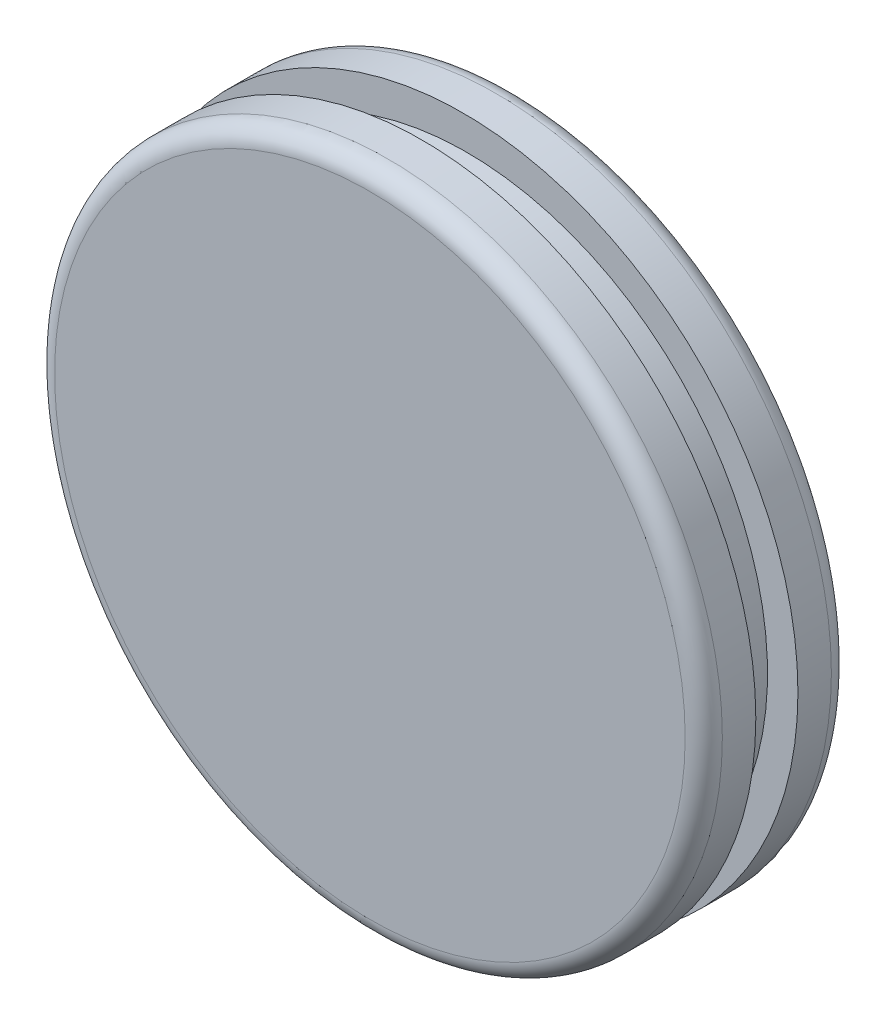
ISO-10303-21;
HEADER;
FILE_DESCRIPTION(('STEP AP214'),'2;1');
FILE_NAME('part.step','',(''),(''),'','','');
FILE_SCHEMA(('AUTOMOTIVE_DESIGN { 1 0 10303 214 1 1 1 1 }'));
ENDSEC;
DATA;
#1=APPLICATION_CONTEXT('core data for automotive mechanical design processes');
#2=APPLICATION_PROTOCOL_DEFINITION('international standard','automotive_design',2000,#1);
#3=PRODUCT_CONTEXT('',#1,'mechanical');
#4=PRODUCT('Part','Part','',(#3));
#5=PRODUCT_RELATED_PRODUCT_CATEGORY('part','',(#4));
#6=PRODUCT_DEFINITION_FORMATION('','',#4);
#7=PRODUCT_DEFINITION_CONTEXT('part definition',#1,'design');
#8=PRODUCT_DEFINITION('design','',#6,#7);
#9=PRODUCT_DEFINITION_SHAPE('','',#8);
#10=(LENGTH_UNIT() NAMED_UNIT(*) SI_UNIT(.MILLI.,.METRE.));
#11=(NAMED_UNIT(*) PLANE_ANGLE_UNIT() SI_UNIT($,.RADIAN.));
#12=(NAMED_UNIT(*) SI_UNIT($,.STERADIAN.) SOLID_ANGLE_UNIT());
#13=UNCERTAINTY_MEASURE_WITH_UNIT(LENGTH_MEASURE(1.E-05),#10,'distance_accuracy_value','');
#14=(GEOMETRIC_REPRESENTATION_CONTEXT(3) GLOBAL_UNCERTAINTY_ASSIGNED_CONTEXT((#13)) GLOBAL_UNIT_ASSIGNED_CONTEXT((#10,
#11,#12)) REPRESENTATION_CONTEXT('',''));
#15=CARTESIAN_POINT('',(0.,0.,0.));
#16=DIRECTION('',(0.,0.,1.));
#17=DIRECTION('',(1.,0.,0.));
#18=AXIS2_PLACEMENT_3D('',#15,#16,#17);
#19=CARTESIAN_POINT('',(0.,0.,3.556));
#20=DIRECTION('',(0.,0.,-1.));
#21=DIRECTION('',(-1.,0.,0.));
#22=AXIS2_PLACEMENT_3D('',#19,#20,#21);
#23=CYLINDRICAL_SURFACE('',#22,22.8119574669442);
#24=CARTESIAN_POINT('',(0.,0.,2.286));
#25=DIRECTION('',(0.,0.,1.));
#26=DIRECTION('',(1.,0.,0.));
#27=AXIS2_PLACEMENT_3D('',#24,#25,#26);
#28=CIRCLE('',#27,22.8119574669442);
#29=CARTESIAN_POINT('',(22.8119574669442,0.,2.286));
#30=VERTEX_POINT('',#29);
#31=EDGE_CURVE('E48',#30,#30,#28,.F.);
#32=ORIENTED_EDGE('',*,*,#31,.T.);
#33=EDGE_LOOP('',(#32));
#34=FACE_BOUND('',#33,.T.);
#35=CARTESIAN_POINT('',(0.,0.,0.));
#36=DIRECTION('',(0.,0.,1.));
#37=DIRECTION('',(1.,0.,0.));
#38=AXIS2_PLACEMENT_3D('',#35,#36,#37);
#39=CIRCLE('',#38,22.8119574669442);
#40=CARTESIAN_POINT('',(22.8119574669442,0.,0.));
#41=VERTEX_POINT('',#40);
#42=EDGE_CURVE('E58',#41,#41,#39,.T.);
#43=ORIENTED_EDGE('',*,*,#42,.T.);
#44=EDGE_LOOP('',(#43));
#45=FACE_BOUND('',#44,.T.);
#46=ADVANCED_FACE('F37',(#34,#45),#23,.T.);
#47=CARTESIAN_POINT('',(0.,0.,3.556));
#48=DIRECTION('',(0.,0.,1.));
#49=DIRECTION('',(1.,0.,0.));
#50=AXIS2_PLACEMENT_3D('',#47,#48,#49);
#51=PLANE('',#50);
#52=CARTESIAN_POINT('',(0.,0.,3.556));
#53=DIRECTION('',(0.,0.,1.));
#54=DIRECTION('',(1.,0.,0.));
#55=AXIS2_PLACEMENT_3D('',#52,#53,#54);
#56=CIRCLE('',#55,21.5419574669442);
#57=CARTESIAN_POINT('',(21.5419574669442,0.,3.556));
#58=VERTEX_POINT('',#57);
#59=EDGE_CURVE('E52',#58,#58,#56,.T.);
#60=ORIENTED_EDGE('',*,*,#59,.T.);
#61=EDGE_LOOP('',(#60));
#62=FACE_BOUND('',#61,.T.);
#63=ADVANCED_FACE('F86',(#62),#51,.T.);
#64=CARTESIAN_POINT('',(0.,0.,0.));
#65=DIRECTION('',(0.,0.,1.));
#66=DIRECTION('',(1.,0.,0.));
#67=AXIS2_PLACEMENT_3D('',#64,#65,#66);
#68=PLANE('',#67);
#69=CARTESIAN_POINT('',(0.,0.,0.));
#70=DIRECTION('',(0.,0.,-1.));
#71=DIRECTION('',(-1.,0.,0.));
#72=AXIS2_PLACEMENT_3D('',#69,#70,#71);
#73=CIRCLE('',#72,20.5653154438536);
#74=CARTESIAN_POINT('',(-20.5653154438536,0.,0.));
#75=VERTEX_POINT('',#74);
#76=EDGE_CURVE('E57',#75,#75,#73,.T.);
#77=ORIENTED_EDGE('',*,*,#76,.F.);
#78=EDGE_LOOP('',(#77));
#79=FACE_BOUND('',#78,.T.);
#80=ORIENTED_EDGE('',*,*,#42,.F.);
#81=EDGE_LOOP('',(#80));
#82=FACE_BOUND('',#81,.T.);
#83=ADVANCED_FACE('F92',(#79,#82),#68,.F.);
#84=CARTESIAN_POINT('',(0.,0.,-3.048));
#85=DIRECTION('',(0.,0.,1.));
#86=DIRECTION('',(1.,0.,0.));
#87=AXIS2_PLACEMENT_3D('',#84,#85,#86);
#88=CYLINDRICAL_SURFACE('',#87,20.5653154438536);
#89=CARTESIAN_POINT('',(0.,0.,-3.048));
#90=DIRECTION('',(0.,0.,-1.));
#91=DIRECTION('',(-1.,0.,0.));
#92=AXIS2_PLACEMENT_3D('',#89,#90,#91);
#93=CIRCLE('',#92,20.5653154438536);
#94=CARTESIAN_POINT('',(-20.5653154438536,0.,-3.048));
#95=VERTEX_POINT('',#94);
#96=EDGE_CURVE('E61',#95,#95,#93,.T.);
#97=ORIENTED_EDGE('',*,*,#96,.F.);
#98=EDGE_LOOP('',(#97));
#99=FACE_BOUND('',#98,.T.);
#100=ORIENTED_EDGE('',*,*,#76,.T.);
#101=EDGE_LOOP('',(#100));
#102=FACE_BOUND('',#101,.T.);
#103=ADVANCED_FACE('F98',(#99,#102),#88,.T.);
#104=CARTESIAN_POINT('',(-0.218012300747005,-0.0984670971107167,-6.604));
#105=DIRECTION('',(0.,0.,1.));
#106=DIRECTION('',(1.,0.,0.));
#107=AXIS2_PLACEMENT_3D('',#104,#105,#106);
#108=CYLINDRICAL_SURFACE('',#107,22.86);
#109=CARTESIAN_POINT('',(-0.218012300747005,-0.0984670971107167,-5.334));
#110=DIRECTION('',(0.,0.,-1.));
#111=DIRECTION('',(-1.,0.,0.));
#112=AXIS2_PLACEMENT_3D('',#109,#110,#111);
#113=CIRCLE('',#112,22.86);
#114=CARTESIAN_POINT('',(-23.078012300747,-0.0984670971107167,-5.334));
#115=VERTEX_POINT('',#114);
#116=EDGE_CURVE('E10',#115,#115,#113,.F.);
#117=ORIENTED_EDGE('',*,*,#116,.T.);
#118=EDGE_LOOP('',(#117));
#119=FACE_BOUND('',#118,.T.);
#120=CARTESIAN_POINT('',(-0.218012300747005,-0.0984670971107167,-3.048));
#121=DIRECTION('',(0.,0.,-1.));
#122=DIRECTION('',(-1.,0.,0.));
#123=AXIS2_PLACEMENT_3D('',#120,#121,#122);
#124=CIRCLE('',#123,22.86);
#125=CARTESIAN_POINT('',(-23.078012300747,-0.0984670971107167,-3.048));
#126=VERTEX_POINT('',#125);
#127=EDGE_CURVE('E66',#126,#126,#124,.T.);
#128=ORIENTED_EDGE('',*,*,#127,.T.);
#129=EDGE_LOOP('',(#128));
#130=FACE_BOUND('',#129,.T.);
#131=ADVANCED_FACE('F70',(#119,#130),#108,.T.);
#132=CARTESIAN_POINT('',(-0.218012300747005,-0.0984670971107167,-6.604));
#133=DIRECTION('',(0.,0.,-1.));
#134=DIRECTION('',(-1.,0.,0.));
#135=AXIS2_PLACEMENT_3D('',#132,#133,#134);
#136=PLANE('',#135);
#137=CARTESIAN_POINT('',(-0.218012300747005,-0.0984670971107167,-6.604));
#138=DIRECTION('',(0.,0.,-1.));
#139=DIRECTION('',(-1.,0.,0.));
#140=AXIS2_PLACEMENT_3D('',#137,#138,#139);
#141=CIRCLE('',#140,21.59);
#142=CARTESIAN_POINT('',(-21.808012300747,-0.0984670971107167,-6.604));
#143=VERTEX_POINT('',#142);
#144=EDGE_CURVE('E44',#143,#143,#141,.T.);
#145=ORIENTED_EDGE('',*,*,#144,.T.);
#146=EDGE_LOOP('',(#145));
#147=FACE_BOUND('',#146,.T.);
#148=ADVANCED_FACE('F75',(#147),#136,.T.);
#149=CARTESIAN_POINT('',(-0.218012300747005,-0.0984670971107167,-3.048));
#150=DIRECTION('',(0.,0.,-1.));
#151=DIRECTION('',(-1.,0.,0.));
#152=AXIS2_PLACEMENT_3D('',#149,#150,#151);
#153=PLANE('',#152);
#154=ORIENTED_EDGE('',*,*,#96,.T.);
#155=EDGE_LOOP('',(#154));
#156=FACE_BOUND('',#155,.T.);
#157=ORIENTED_EDGE('',*,*,#127,.F.);
#158=EDGE_LOOP('',(#157));
#159=FACE_BOUND('',#158,.T.);
#160=ADVANCED_FACE('F72',(#156,#159),#153,.F.);
#161=CARTESIAN_POINT('',(0.,0.,2.286));
#162=DIRECTION('',(0.,0.,1.));
#163=DIRECTION('',(1.,0.,0.));
#164=AXIS2_PLACEMENT_3D('',#161,#162,#163);
#165=TOROIDAL_SURFACE('',#164,21.5419574669442,1.27);
#166=ORIENTED_EDGE('',*,*,#31,.F.);
#167=EDGE_LOOP('',(#166));
#168=FACE_BOUND('',#167,.T.);
#169=ORIENTED_EDGE('',*,*,#59,.F.);
#170=EDGE_LOOP('',(#169));
#171=FACE_BOUND('',#170,.T.);
#172=ADVANCED_FACE('F74',(#168,#171),#165,.T.);
#173=CARTESIAN_POINT('',(-0.218012300747005,-0.0984670971107167,-5.334));
#174=DIRECTION('',(0.,0.,-1.));
#175=DIRECTION('',(-1.,0.,0.));
#176=AXIS2_PLACEMENT_3D('',#173,#174,#175);
#177=TOROIDAL_SURFACE('',#176,21.59,1.27);
#178=ORIENTED_EDGE('',*,*,#116,.F.);
#179=EDGE_LOOP('',(#178));
#180=FACE_BOUND('',#179,.T.);
#181=ORIENTED_EDGE('',*,*,#144,.F.);
#182=EDGE_LOOP('',(#181));
#183=FACE_BOUND('',#182,.T.);
#184=ADVANCED_FACE('F39',(#180,#183),#177,.T.);
#185=CLOSED_SHELL('',(#46,#63,#83,#103,#131,#148,#160,#172,#184));
#186=MANIFOLD_SOLID_BREP('B2',#185);
#187=ADVANCED_BREP_SHAPE_REPRESENTATION('',(#18,#186),#14);
#188=SHAPE_DEFINITION_REPRESENTATION(#9,#187);
ENDSEC;
END-ISO-10303-21;
